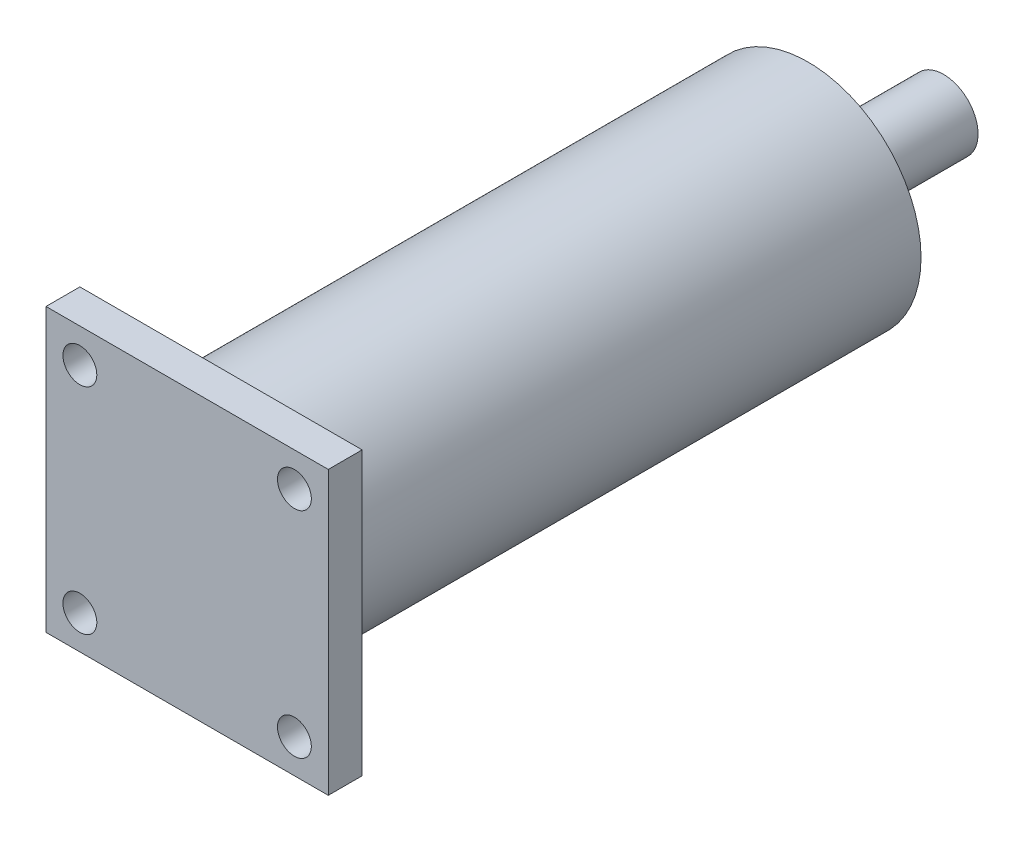
ISO-10303-21;
HEADER;
FILE_DESCRIPTION(('STEP AP214'),'2;1');
FILE_NAME('part.step','',(''),(''),'','','');
FILE_SCHEMA(('AUTOMOTIVE_DESIGN { 1 0 10303 214 1 1 1 1 }'));
ENDSEC;
DATA;
#1=APPLICATION_CONTEXT('core data for automotive mechanical design processes');
#2=APPLICATION_PROTOCOL_DEFINITION('international standard','automotive_design',2000,#1);
#3=PRODUCT_CONTEXT('',#1,'mechanical');
#4=PRODUCT('Part','Part','',(#3));
#5=PRODUCT_RELATED_PRODUCT_CATEGORY('part','',(#4));
#6=PRODUCT_DEFINITION_FORMATION('','',#4);
#7=PRODUCT_DEFINITION_CONTEXT('part definition',#1,'design');
#8=PRODUCT_DEFINITION('design','',#6,#7);
#9=PRODUCT_DEFINITION_SHAPE('','',#8);
#10=(LENGTH_UNIT() NAMED_UNIT(*) SI_UNIT(.MILLI.,.METRE.));
#11=(NAMED_UNIT(*) PLANE_ANGLE_UNIT() SI_UNIT($,.RADIAN.));
#12=(NAMED_UNIT(*) SI_UNIT($,.STERADIAN.) SOLID_ANGLE_UNIT());
#13=UNCERTAINTY_MEASURE_WITH_UNIT(LENGTH_MEASURE(1.E-05),#10,'distance_accuracy_value','');
#14=(GEOMETRIC_REPRESENTATION_CONTEXT(3) GLOBAL_UNCERTAINTY_ASSIGNED_CONTEXT((#13)) GLOBAL_UNIT_ASSIGNED_CONTEXT((#10,
#11,#12)) REPRESENTATION_CONTEXT('',''));
#15=CARTESIAN_POINT('',(0.,0.,0.));
#16=DIRECTION('',(0.,0.,1.));
#17=DIRECTION('',(1.,0.,0.));
#18=AXIS2_PLACEMENT_3D('',#15,#16,#17);
#19=CARTESIAN_POINT('',(0.,0.,3.));
#20=DIRECTION('',(1.,0.,0.));
#21=DIRECTION('',(0.,1.,0.));
#22=AXIS2_PLACEMENT_3D('',#19,#20,#21);
#23=PLANE('',#22);
#24=DIRECTION('',(0.,-1.,0.));
#25=VECTOR('',#24,1.);
#26=CARTESIAN_POINT('',(0.,0.,0.));
#27=LINE('',#26,#25);
#28=CARTESIAN_POINT('',(0.,0.,0.));
#29=VERTEX_POINT('',#28);
#30=CARTESIAN_POINT('',(0.,-25.,0.));
#31=VERTEX_POINT('',#30);
#32=EDGE_CURVE('E99',#29,#31,#27,.T.);
#33=ORIENTED_EDGE('',*,*,#32,.T.);
#34=DIRECTION('',(0.,0.,-1.));
#35=VECTOR('',#34,1.);
#36=CARTESIAN_POINT('',(0.,-25.,3.));
#37=LINE('',#36,#35);
#38=CARTESIAN_POINT('',(0.,-25.,3.));
#39=VERTEX_POINT('',#38);
#40=EDGE_CURVE('E36',#39,#31,#37,.T.);
#41=ORIENTED_EDGE('',*,*,#40,.F.);
#42=DIRECTION('',(0.,-1.,0.));
#43=VECTOR('',#42,1.);
#44=CARTESIAN_POINT('',(0.,0.,3.));
#45=LINE('',#44,#43);
#46=CARTESIAN_POINT('',(0.,0.,3.));
#47=VERTEX_POINT('',#46);
#48=EDGE_CURVE('E86',#47,#39,#45,.T.);
#49=ORIENTED_EDGE('',*,*,#48,.F.);
#50=DIRECTION('',(0.,0.,-1.));
#51=VECTOR('',#50,1.);
#52=CARTESIAN_POINT('',(0.,0.,3.));
#53=LINE('',#52,#51);
#54=EDGE_CURVE('E95',#47,#29,#53,.T.);
#55=ORIENTED_EDGE('',*,*,#54,.T.);
#56=EDGE_LOOP('',(#33,#41,#49,#55));
#57=FACE_BOUND('',#56,.T.);
#58=ADVANCED_FACE('F33',(#57),#23,.F.);
#59=CARTESIAN_POINT('',(0.,-25.,3.));
#60=DIRECTION('',(0.,1.,0.));
#61=DIRECTION('',(0.,0.,1.));
#62=AXIS2_PLACEMENT_3D('',#59,#60,#61);
#63=PLANE('',#62);
#64=DIRECTION('',(1.,0.,0.));
#65=VECTOR('',#64,1.);
#66=CARTESIAN_POINT('',(0.,-25.,0.));
#67=LINE('',#66,#65);
#68=CARTESIAN_POINT('',(25.,-25.,0.));
#69=VERTEX_POINT('',#68);
#70=EDGE_CURVE('E91',#31,#69,#67,.T.);
#71=ORIENTED_EDGE('',*,*,#70,.T.);
#72=DIRECTION('',(0.,0.,-1.));
#73=VECTOR('',#72,1.);
#74=CARTESIAN_POINT('',(25.,-25.,3.));
#75=LINE('',#74,#73);
#76=CARTESIAN_POINT('',(25.,-25.,3.));
#77=VERTEX_POINT('',#76);
#78=EDGE_CURVE('E89',#77,#69,#75,.T.);
#79=ORIENTED_EDGE('',*,*,#78,.F.);
#80=DIRECTION('',(1.,0.,0.));
#81=VECTOR('',#80,1.);
#82=CARTESIAN_POINT('',(0.,-25.,3.));
#83=LINE('',#82,#81);
#84=EDGE_CURVE('E81',#39,#77,#83,.T.);
#85=ORIENTED_EDGE('',*,*,#84,.F.);
#86=ORIENTED_EDGE('',*,*,#40,.T.);
#87=EDGE_LOOP('',(#71,#79,#85,#86));
#88=FACE_BOUND('',#87,.T.);
#89=ADVANCED_FACE('F90',(#88),#63,.F.);
#90=CARTESIAN_POINT('',(25.,0.,3.));
#91=DIRECTION('',(-1.,0.,0.));
#92=DIRECTION('',(0.,-1.,0.));
#93=AXIS2_PLACEMENT_3D('',#90,#91,#92);
#94=PLANE('',#93);
#95=DIRECTION('',(0.,1.,0.));
#96=VECTOR('',#95,1.);
#97=CARTESIAN_POINT('',(25.,0.,0.));
#98=LINE('',#97,#96);
#99=CARTESIAN_POINT('',(25.,0.,0.));
#100=VERTEX_POINT('',#99);
#101=EDGE_CURVE('E67',#69,#100,#98,.T.);
#102=ORIENTED_EDGE('',*,*,#101,.T.);
#103=DIRECTION('',(0.,0.,-1.));
#104=VECTOR('',#103,1.);
#105=CARTESIAN_POINT('',(25.,0.,3.));
#106=LINE('',#105,#104);
#107=CARTESIAN_POINT('',(25.,0.,3.));
#108=VERTEX_POINT('',#107);
#109=EDGE_CURVE('E92',#108,#100,#106,.T.);
#110=ORIENTED_EDGE('',*,*,#109,.F.);
#111=DIRECTION('',(0.,1.,0.));
#112=VECTOR('',#111,1.);
#113=CARTESIAN_POINT('',(25.,0.,3.));
#114=LINE('',#113,#112);
#115=EDGE_CURVE('E84',#77,#108,#114,.T.);
#116=ORIENTED_EDGE('',*,*,#115,.F.);
#117=ORIENTED_EDGE('',*,*,#78,.T.);
#118=EDGE_LOOP('',(#102,#110,#116,#117));
#119=FACE_BOUND('',#118,.T.);
#120=ADVANCED_FACE('F93',(#119),#94,.F.);
#121=CARTESIAN_POINT('',(0.,0.,3.));
#122=DIRECTION('',(0.,-1.,0.));
#123=DIRECTION('',(0.,0.,-1.));
#124=AXIS2_PLACEMENT_3D('',#121,#122,#123);
#125=PLANE('',#124);
#126=DIRECTION('',(-1.,0.,0.));
#127=VECTOR('',#126,1.);
#128=CARTESIAN_POINT('',(0.,0.,0.));
#129=LINE('',#128,#127);
#130=EDGE_CURVE('E73',#100,#29,#129,.T.);
#131=ORIENTED_EDGE('',*,*,#130,.T.);
#132=ORIENTED_EDGE('',*,*,#54,.F.);
#133=DIRECTION('',(-1.,0.,0.));
#134=VECTOR('',#133,1.);
#135=CARTESIAN_POINT('',(0.,0.,3.));
#136=LINE('',#135,#134);
#137=EDGE_CURVE('E50',#108,#47,#136,.T.);
#138=ORIENTED_EDGE('',*,*,#137,.F.);
#139=ORIENTED_EDGE('',*,*,#109,.T.);
#140=EDGE_LOOP('',(#131,#132,#138,#139));
#141=FACE_BOUND('',#140,.T.);
#142=ADVANCED_FACE('F107',(#141),#125,.F.);
#143=CARTESIAN_POINT('',(0.,0.,3.));
#144=DIRECTION('',(0.,0.,1.));
#145=DIRECTION('',(1.,0.,0.));
#146=AXIS2_PLACEMENT_3D('',#143,#144,#145);
#147=PLANE('',#146);
#148=CARTESIAN_POINT('',(22.,-22.,3.));
#149=DIRECTION('',(0.,0.,-1.));
#150=DIRECTION('',(1.,0.,0.));
#151=AXIS2_PLACEMENT_3D('',#148,#149,#150);
#152=CIRCLE('',#151,1.5);
#153=CARTESIAN_POINT('',(23.5,-22.,3.));
#154=VERTEX_POINT('',#153);
#155=EDGE_CURVE('E122',#154,#154,#152,.T.);
#156=ORIENTED_EDGE('',*,*,#155,.T.);
#157=EDGE_LOOP('',(#156));
#158=FACE_BOUND('',#157,.T.);
#159=CARTESIAN_POINT('',(3.,-22.,3.));
#160=DIRECTION('',(0.,0.,-1.));
#161=DIRECTION('',(-1.,0.,0.));
#162=AXIS2_PLACEMENT_3D('',#159,#160,#161);
#163=CIRCLE('',#162,1.5);
#164=CARTESIAN_POINT('',(1.49999999999999,-22.,3.));
#165=VERTEX_POINT('',#164);
#166=EDGE_CURVE('E129',#165,#165,#163,.T.);
#167=ORIENTED_EDGE('',*,*,#166,.T.);
#168=EDGE_LOOP('',(#167));
#169=FACE_BOUND('',#168,.T.);
#170=CARTESIAN_POINT('',(3.,-3.,3.));
#171=DIRECTION('',(0.,0.,-1.));
#172=DIRECTION('',(1.,0.,0.));
#173=AXIS2_PLACEMENT_3D('',#170,#171,#172);
#174=CIRCLE('',#173,1.5);
#175=CARTESIAN_POINT('',(4.5,-3.,3.));
#176=VERTEX_POINT('',#175);
#177=EDGE_CURVE('E116',#176,#176,#174,.T.);
#178=ORIENTED_EDGE('',*,*,#177,.T.);
#179=EDGE_LOOP('',(#178));
#180=FACE_BOUND('',#179,.T.);
#181=CARTESIAN_POINT('',(22.,-3.,3.));
#182=DIRECTION('',(0.,0.,-1.));
#183=DIRECTION('',(-1.,0.,0.));
#184=AXIS2_PLACEMENT_3D('',#181,#182,#183);
#185=CIRCLE('',#184,1.5);
#186=CARTESIAN_POINT('',(20.5,-3.,3.));
#187=VERTEX_POINT('',#186);
#188=EDGE_CURVE('E102',#187,#187,#185,.T.);
#189=ORIENTED_EDGE('',*,*,#188,.T.);
#190=EDGE_LOOP('',(#189));
#191=FACE_BOUND('',#190,.T.);
#192=ORIENTED_EDGE('',*,*,#48,.T.);
#193=ORIENTED_EDGE('',*,*,#84,.T.);
#194=ORIENTED_EDGE('',*,*,#115,.T.);
#195=ORIENTED_EDGE('',*,*,#137,.T.);
#196=EDGE_LOOP('',(#192,#193,#194,#195));
#197=FACE_BOUND('',#196,.T.);
#198=ADVANCED_FACE('F82',(#158,#169,#180,#191,#197),#147,.T.);
#199=CARTESIAN_POINT('',(0.,0.,0.));
#200=DIRECTION('',(0.,0.,1.));
#201=DIRECTION('',(1.,0.,0.));
#202=AXIS2_PLACEMENT_3D('',#199,#200,#201);
#203=PLANE('',#202);
#204=CARTESIAN_POINT('',(12.5,-12.5,0.));
#205=DIRECTION('',(0.,0.,1.));
#206=DIRECTION('',(1.,0.,0.));
#207=AXIS2_PLACEMENT_3D('',#204,#205,#206);
#208=CIRCLE('',#207,10.);
#209=CARTESIAN_POINT('',(22.5,-12.5,0.));
#210=VERTEX_POINT('',#209);
#211=EDGE_CURVE('E137',#210,#210,#208,.T.);
#212=ORIENTED_EDGE('',*,*,#211,.T.);
#213=EDGE_LOOP('',(#212));
#214=FACE_BOUND('',#213,.T.);
#215=CARTESIAN_POINT('',(22.,-22.,0.));
#216=DIRECTION('',(0.,0.,-1.));
#217=DIRECTION('',(1.,0.,0.));
#218=AXIS2_PLACEMENT_3D('',#215,#216,#217);
#219=CIRCLE('',#218,1.5);
#220=CARTESIAN_POINT('',(23.5,-22.,0.));
#221=VERTEX_POINT('',#220);
#222=EDGE_CURVE('E119',#221,#221,#219,.T.);
#223=ORIENTED_EDGE('',*,*,#222,.F.);
#224=EDGE_LOOP('',(#223));
#225=FACE_BOUND('',#224,.T.);
#226=CARTESIAN_POINT('',(3.,-22.,0.));
#227=DIRECTION('',(0.,0.,-1.));
#228=DIRECTION('',(-1.,0.,0.));
#229=AXIS2_PLACEMENT_3D('',#226,#227,#228);
#230=CIRCLE('',#229,1.5);
#231=CARTESIAN_POINT('',(1.49999999999999,-22.,0.));
#232=VERTEX_POINT('',#231);
#233=EDGE_CURVE('E126',#232,#232,#230,.T.);
#234=ORIENTED_EDGE('',*,*,#233,.F.);
#235=EDGE_LOOP('',(#234));
#236=FACE_BOUND('',#235,.T.);
#237=CARTESIAN_POINT('',(3.,-3.,0.));
#238=DIRECTION('',(0.,0.,-1.));
#239=DIRECTION('',(1.,0.,0.));
#240=AXIS2_PLACEMENT_3D('',#237,#238,#239);
#241=CIRCLE('',#240,1.5);
#242=CARTESIAN_POINT('',(4.5,-3.,0.));
#243=VERTEX_POINT('',#242);
#244=EDGE_CURVE('E132',#243,#243,#241,.T.);
#245=ORIENTED_EDGE('',*,*,#244,.F.);
#246=EDGE_LOOP('',(#245));
#247=FACE_BOUND('',#246,.T.);
#248=CARTESIAN_POINT('',(22.,-3.,0.));
#249=DIRECTION('',(0.,0.,-1.));
#250=DIRECTION('',(-1.,0.,0.));
#251=AXIS2_PLACEMENT_3D('',#248,#249,#250);
#252=CIRCLE('',#251,1.5);
#253=CARTESIAN_POINT('',(20.5,-3.,0.));
#254=VERTEX_POINT('',#253);
#255=EDGE_CURVE('E113',#254,#254,#252,.T.);
#256=ORIENTED_EDGE('',*,*,#255,.F.);
#257=EDGE_LOOP('',(#256));
#258=FACE_BOUND('',#257,.T.);
#259=ORIENTED_EDGE('',*,*,#32,.F.);
#260=ORIENTED_EDGE('',*,*,#130,.F.);
#261=ORIENTED_EDGE('',*,*,#101,.F.);
#262=ORIENTED_EDGE('',*,*,#70,.F.);
#263=EDGE_LOOP('',(#259,#260,#261,#262));
#264=FACE_BOUND('',#263,.T.);
#265=ADVANCED_FACE('F110',(#214,#225,#236,#247,#258,#264),#203,.F.);
#266=CARTESIAN_POINT('',(22.,-3.,3.));
#267=DIRECTION('',(0.,0.,-1.));
#268=DIRECTION('',(-1.,0.,0.));
#269=AXIS2_PLACEMENT_3D('',#266,#267,#268);
#270=CYLINDRICAL_SURFACE('',#269,1.5);
#271=ORIENTED_EDGE('',*,*,#188,.F.);
#272=EDGE_LOOP('',(#271));
#273=FACE_BOUND('',#272,.T.);
#274=ORIENTED_EDGE('',*,*,#255,.T.);
#275=EDGE_LOOP('',(#274));
#276=FACE_BOUND('',#275,.T.);
#277=ADVANCED_FACE('F169',(#273,#276),#270,.F.);
#278=CARTESIAN_POINT('',(3.,-3.,3.));
#279=DIRECTION('',(0.,0.,-1.));
#280=DIRECTION('',(-1.,0.,0.));
#281=AXIS2_PLACEMENT_3D('',#278,#279,#280);
#282=CYLINDRICAL_SURFACE('',#281,1.5);
#283=ORIENTED_EDGE('',*,*,#177,.F.);
#284=EDGE_LOOP('',(#283));
#285=FACE_BOUND('',#284,.T.);
#286=ORIENTED_EDGE('',*,*,#244,.T.);
#287=EDGE_LOOP('',(#286));
#288=FACE_BOUND('',#287,.T.);
#289=ADVANCED_FACE('F180',(#285,#288),#282,.F.);
#290=CARTESIAN_POINT('',(3.,-22.,3.));
#291=DIRECTION('',(0.,0.,-1.));
#292=DIRECTION('',(-1.,0.,0.));
#293=AXIS2_PLACEMENT_3D('',#290,#291,#292);
#294=CYLINDRICAL_SURFACE('',#293,1.5);
#295=ORIENTED_EDGE('',*,*,#166,.F.);
#296=EDGE_LOOP('',(#295));
#297=FACE_BOUND('',#296,.T.);
#298=ORIENTED_EDGE('',*,*,#233,.T.);
#299=EDGE_LOOP('',(#298));
#300=FACE_BOUND('',#299,.T.);
#301=ADVANCED_FACE('F186',(#297,#300),#294,.F.);
#302=CARTESIAN_POINT('',(22.,-22.,3.));
#303=DIRECTION('',(0.,0.,-1.));
#304=DIRECTION('',(-1.,0.,0.));
#305=AXIS2_PLACEMENT_3D('',#302,#303,#304);
#306=CYLINDRICAL_SURFACE('',#305,1.5);
#307=ORIENTED_EDGE('',*,*,#155,.F.);
#308=EDGE_LOOP('',(#307));
#309=FACE_BOUND('',#308,.T.);
#310=ORIENTED_EDGE('',*,*,#222,.T.);
#311=EDGE_LOOP('',(#310));
#312=FACE_BOUND('',#311,.T.);
#313=ADVANCED_FACE('F163',(#309,#312),#306,.F.);
#314=CARTESIAN_POINT('',(12.5,-12.5,-52.));
#315=DIRECTION('',(0.,0.,1.));
#316=DIRECTION('',(1.,0.,0.));
#317=AXIS2_PLACEMENT_3D('',#314,#315,#316);
#318=CYLINDRICAL_SURFACE('',#317,10.);
#319=CARTESIAN_POINT('',(12.5,-12.5,-52.));
#320=DIRECTION('',(0.,0.,1.));
#321=DIRECTION('',(1.,0.,0.));
#322=AXIS2_PLACEMENT_3D('',#319,#320,#321);
#323=CIRCLE('',#322,10.);
#324=CARTESIAN_POINT('',(22.5,-12.5,-52.));
#325=VERTEX_POINT('',#324);
#326=EDGE_CURVE('E123',#325,#325,#323,.T.);
#327=ORIENTED_EDGE('',*,*,#326,.T.);
#328=EDGE_LOOP('',(#327));
#329=FACE_BOUND('',#328,.T.);
#330=ORIENTED_EDGE('',*,*,#211,.F.);
#331=EDGE_LOOP('',(#330));
#332=FACE_BOUND('',#331,.T.);
#333=ADVANCED_FACE('F157',(#329,#332),#318,.T.);
#334=CARTESIAN_POINT('',(12.5,-12.5,-52.));
#335=DIRECTION('',(0.,0.,1.));
#336=DIRECTION('',(1.,0.,0.));
#337=AXIS2_PLACEMENT_3D('',#334,#335,#336);
#338=PLANE('',#337);
#339=CARTESIAN_POINT('',(12.5,-12.5,-52.));
#340=DIRECTION('',(0.,0.,-1.));
#341=DIRECTION('',(-1.,0.,0.));
#342=AXIS2_PLACEMENT_3D('',#339,#340,#341);
#343=CIRCLE('',#342,3.05);
#344=CARTESIAN_POINT('',(9.45,-12.5,-52.));
#345=VERTEX_POINT('',#344);
#346=EDGE_CURVE('E11',#345,#345,#343,.T.);
#347=ORIENTED_EDGE('',*,*,#346,.F.);
#348=EDGE_LOOP('',(#347));
#349=FACE_BOUND('',#348,.T.);
#350=ORIENTED_EDGE('',*,*,#326,.F.);
#351=EDGE_LOOP('',(#350));
#352=FACE_BOUND('',#351,.T.);
#353=ADVANCED_FACE('F151',(#349,#352),#338,.F.);
#354=CARTESIAN_POINT('',(12.5,-12.5,-64.));
#355=DIRECTION('',(0.,0.,1.));
#356=DIRECTION('',(1.,0.,0.));
#357=AXIS2_PLACEMENT_3D('',#354,#355,#356);
#358=CYLINDRICAL_SURFACE('',#357,3.05);
#359=CARTESIAN_POINT('',(12.5,-12.5,-64.));
#360=DIRECTION('',(0.,0.,-1.));
#361=DIRECTION('',(-1.,0.,0.));
#362=AXIS2_PLACEMENT_3D('',#359,#360,#361);
#363=CIRCLE('',#362,3.05);
#364=CARTESIAN_POINT('',(9.45,-12.5,-64.));
#365=VERTEX_POINT('',#364);
#366=EDGE_CURVE('E140',#365,#365,#363,.T.);
#367=ORIENTED_EDGE('',*,*,#366,.F.);
#368=EDGE_LOOP('',(#367));
#369=FACE_BOUND('',#368,.T.);
#370=ORIENTED_EDGE('',*,*,#346,.T.);
#371=EDGE_LOOP('',(#370));
#372=FACE_BOUND('',#371,.T.);
#373=ADVANCED_FACE('F148',(#369,#372),#358,.T.);
#374=CARTESIAN_POINT('',(12.5,-12.5,-64.));
#375=DIRECTION('',(0.,0.,-1.));
#376=DIRECTION('',(-1.,0.,0.));
#377=AXIS2_PLACEMENT_3D('',#374,#375,#376);
#378=PLANE('',#377);
#379=ORIENTED_EDGE('',*,*,#366,.T.);
#380=EDGE_LOOP('',(#379));
#381=FACE_BOUND('',#380,.T.);
#382=ADVANCED_FACE('F146',(#381),#378,.T.);
#383=CLOSED_SHELL('',(#58,#89,#120,#142,#198,#265,#277,#289,#301,#313,#333,#353,#373,#382));
#384=MANIFOLD_SOLID_BREP('B2',#383);
#385=ADVANCED_BREP_SHAPE_REPRESENTATION('',(#18,#384),#14);
#386=SHAPE_DEFINITION_REPRESENTATION(#9,#385);
ENDSEC;
END-ISO-10303-21;
